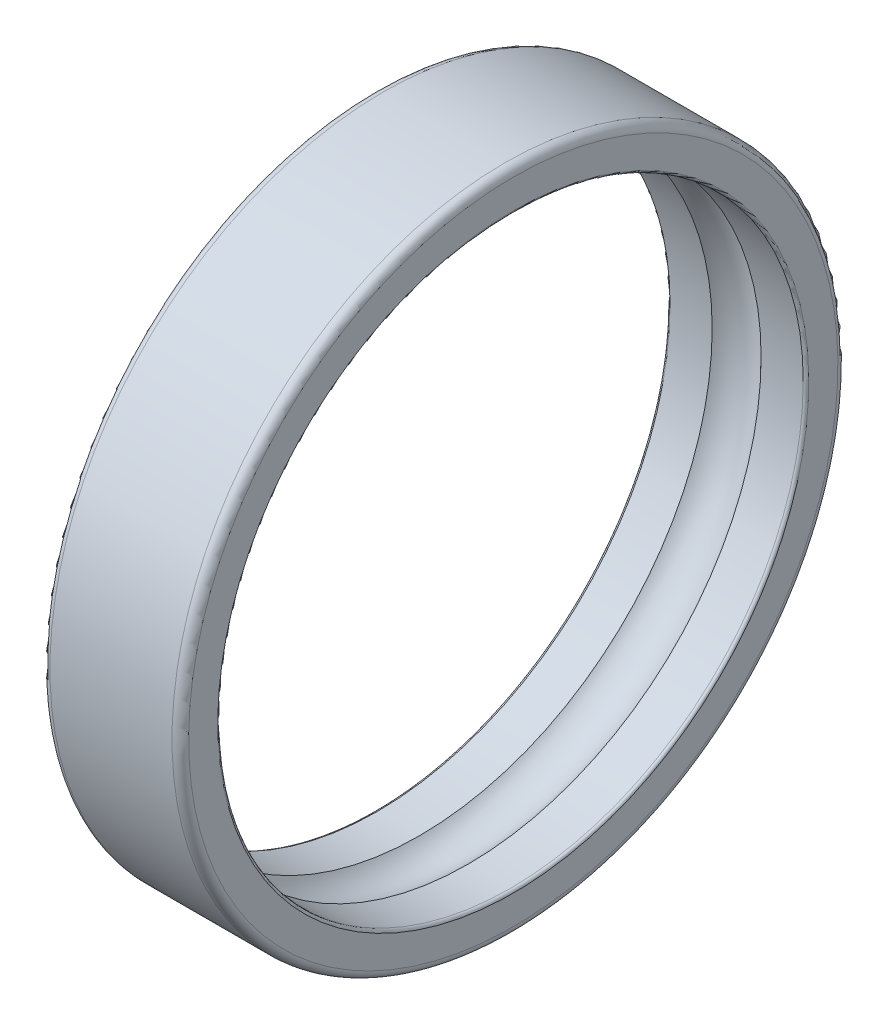
ISO-10303-21;
HEADER;
FILE_DESCRIPTION(('STEP AP214'),'2;1');
FILE_NAME('part.step','',(''),(''),'','','');
FILE_SCHEMA(('AUTOMOTIVE_DESIGN { 1 0 10303 214 1 1 1 1 }'));
ENDSEC;
DATA;
#1=APPLICATION_CONTEXT('core data for automotive mechanical design processes');
#2=APPLICATION_PROTOCOL_DEFINITION('international standard','automotive_design',2000,#1);
#3=PRODUCT_CONTEXT('',#1,'mechanical');
#4=PRODUCT('Part','Part','',(#3));
#5=PRODUCT_RELATED_PRODUCT_CATEGORY('part','',(#4));
#6=PRODUCT_DEFINITION_FORMATION('','',#4);
#7=PRODUCT_DEFINITION_CONTEXT('part definition',#1,'design');
#8=PRODUCT_DEFINITION('design','',#6,#7);
#9=PRODUCT_DEFINITION_SHAPE('','',#8);
#10=(LENGTH_UNIT() NAMED_UNIT(*) SI_UNIT(.MILLI.,.METRE.));
#11=(NAMED_UNIT(*) PLANE_ANGLE_UNIT() SI_UNIT($,.RADIAN.));
#12=(NAMED_UNIT(*) SI_UNIT($,.STERADIAN.) SOLID_ANGLE_UNIT());
#13=UNCERTAINTY_MEASURE_WITH_UNIT(LENGTH_MEASURE(1.E-05),#10,'distance_accuracy_value','');
#14=(GEOMETRIC_REPRESENTATION_CONTEXT(3) GLOBAL_UNCERTAINTY_ASSIGNED_CONTEXT((#13)) GLOBAL_UNIT_ASSIGNED_CONTEXT((#10,
#11,#12)) REPRESENTATION_CONTEXT('',''));
#15=CARTESIAN_POINT('',(0.,0.,0.));
#16=DIRECTION('',(0.,0.,1.));
#17=DIRECTION('',(1.,0.,0.));
#18=AXIS2_PLACEMENT_3D('',#15,#16,#17);
#19=CARTESIAN_POINT('',(0.299999999999946,0.,0.));
#20=DIRECTION('',(1.,0.,0.));
#21=DIRECTION('',(0.,1.,0.));
#22=AXIS2_PLACEMENT_3D('',#19,#20,#21);
#23=TOROIDAL_SURFACE('',#22,11.7000000000001,0.299999999999942);
#24=CARTESIAN_POINT('',(0.,0.,0.));
#25=DIRECTION('',(1.,0.,0.));
#26=DIRECTION('',(0.,1.,0.));
#27=AXIS2_PLACEMENT_3D('',#24,#25,#26);
#28=CIRCLE('',#27,11.7);
#29=CARTESIAN_POINT('',(0.,11.7,0.));
#30=VERTEX_POINT('',#29);
#31=EDGE_CURVE('E10',#30,#30,#28,.T.);
#32=ORIENTED_EDGE('',*,*,#31,.T.);
#33=EDGE_LOOP('',(#32));
#34=FACE_BOUND('',#33,.T.);
#35=CARTESIAN_POINT('',(0.300000000000004,0.,0.));
#36=DIRECTION('',(1.,0.,0.));
#37=DIRECTION('',(0.,1.,0.));
#38=AXIS2_PLACEMENT_3D('',#35,#36,#37);
#39=CIRCLE('',#38,12.);
#40=CARTESIAN_POINT('',(0.3,12.,0.));
#41=VERTEX_POINT('',#40);
#42=EDGE_CURVE('E70',#41,#41,#39,.T.);
#43=ORIENTED_EDGE('',*,*,#42,.F.);
#44=EDGE_LOOP('',(#43));
#45=FACE_BOUND('',#44,.T.);
#46=ADVANCED_FACE('F36',(#34,#45),#23,.T.);
#47=CARTESIAN_POINT('',(0.,11.7,0.));
#48=DIRECTION('',(-1.,0.,0.));
#49=DIRECTION('',(0.,-1.,0.));
#50=AXIS2_PLACEMENT_3D('',#47,#48,#49);
#51=PLANE('',#50);
#52=CARTESIAN_POINT('',(0.,0.,0.));
#53=DIRECTION('',(1.,0.,0.));
#54=DIRECTION('',(0.,1.,0.));
#55=AXIS2_PLACEMENT_3D('',#52,#53,#54);
#56=CIRCLE('',#55,10.65);
#57=CARTESIAN_POINT('',(0.,10.65,0.));
#58=VERTEX_POINT('',#57);
#59=EDGE_CURVE('E42',#58,#58,#56,.T.);
#60=ORIENTED_EDGE('',*,*,#59,.T.);
#61=EDGE_LOOP('',(#60));
#62=FACE_BOUND('',#61,.T.);
#63=ORIENTED_EDGE('',*,*,#31,.F.);
#64=EDGE_LOOP('',(#63));
#65=FACE_BOUND('',#64,.T.);
#66=ADVANCED_FACE('F78',(#62,#65),#51,.T.);
#67=CARTESIAN_POINT('',(0.0999999999994126,0.,0.));
#68=DIRECTION('',(1.,0.,0.));
#69=DIRECTION('',(0.,1.,0.));
#70=AXIS2_PLACEMENT_3D('',#67,#68,#69);
#71=TOROIDAL_SURFACE('',#70,10.6499999999994,0.0999999999994094);
#72=CARTESIAN_POINT('',(0.100000000000004,0.,0.));
#73=DIRECTION('',(1.,0.,0.));
#74=DIRECTION('',(0.,1.,0.));
#75=AXIS2_PLACEMENT_3D('',#72,#73,#74);
#76=CIRCLE('',#75,10.55);
#77=CARTESIAN_POINT('',(0.1,10.55,0.));
#78=VERTEX_POINT('',#77);
#79=EDGE_CURVE('E46',#78,#78,#76,.T.);
#80=ORIENTED_EDGE('',*,*,#79,.T.);
#81=EDGE_LOOP('',(#80));
#82=FACE_BOUND('',#81,.T.);
#83=ORIENTED_EDGE('',*,*,#59,.F.);
#84=EDGE_LOOP('',(#83));
#85=FACE_BOUND('',#84,.T.);
#86=ADVANCED_FACE('F82',(#82,#85),#71,.T.);
#87=CARTESIAN_POINT('',(5.,0.,0.));
#88=DIRECTION('',(1.,0.,0.));
#89=DIRECTION('',(0.,1.,0.));
#90=AXIS2_PLACEMENT_3D('',#87,#88,#89);
#91=CYLINDRICAL_SURFACE('',#90,10.55);
#92=CARTESIAN_POINT('',(1.6183593419085,0.,0.));
#93=DIRECTION('',(1.,0.,0.));
#94=DIRECTION('',(0.,1.,0.));
#95=AXIS2_PLACEMENT_3D('',#92,#93,#94);
#96=CIRCLE('',#95,10.55);
#97=CARTESIAN_POINT('',(1.6183593419085,10.55,0.));
#98=VERTEX_POINT('',#97);
#99=EDGE_CURVE('E50',#98,#98,#96,.T.);
#100=ORIENTED_EDGE('',*,*,#99,.T.);
#101=EDGE_LOOP('',(#100));
#102=FACE_BOUND('',#101,.T.);
#103=ORIENTED_EDGE('',*,*,#79,.F.);
#104=EDGE_LOOP('',(#103));
#105=FACE_BOUND('',#104,.T.);
#106=ADVANCED_FACE('F86',(#102,#105),#91,.F.);
#107=CARTESIAN_POINT('',(2.5,0.,0.));
#108=DIRECTION('',(1.,0.,0.));
#109=DIRECTION('',(0.,1.,0.));
#110=AXIS2_PLACEMENT_3D('',#107,#108,#109);
#111=TOROIDAL_SURFACE('',#110,9.74999999999998,1.19050000000002);
#112=CARTESIAN_POINT('',(3.3816406580915,0.,0.));
#113=DIRECTION('',(1.,0.,0.));
#114=DIRECTION('',(0.,1.,0.));
#115=AXIS2_PLACEMENT_3D('',#112,#113,#114);
#116=CIRCLE('',#115,10.55);
#117=CARTESIAN_POINT('',(3.3816406580915,10.55,0.));
#118=VERTEX_POINT('',#117);
#119=EDGE_CURVE('E55',#118,#118,#116,.T.);
#120=ORIENTED_EDGE('',*,*,#119,.T.);
#121=EDGE_LOOP('',(#120));
#122=FACE_BOUND('',#121,.T.);
#123=ORIENTED_EDGE('',*,*,#99,.F.);
#124=EDGE_LOOP('',(#123));
#125=FACE_BOUND('',#124,.T.);
#126=ADVANCED_FACE('F93',(#122,#125),#111,.F.);
#127=CARTESIAN_POINT('',(5.,0.,0.));
#128=DIRECTION('',(1.,0.,0.));
#129=DIRECTION('',(0.,1.,0.));
#130=AXIS2_PLACEMENT_3D('',#127,#128,#129);
#131=CYLINDRICAL_SURFACE('',#130,10.55);
#132=CARTESIAN_POINT('',(4.9,0.,0.));
#133=DIRECTION('',(1.,0.,0.));
#134=DIRECTION('',(0.,1.,0.));
#135=AXIS2_PLACEMENT_3D('',#132,#133,#134);
#136=CIRCLE('',#135,10.55);
#137=CARTESIAN_POINT('',(4.9,10.55,0.));
#138=VERTEX_POINT('',#137);
#139=EDGE_CURVE('E58',#138,#138,#136,.T.);
#140=ORIENTED_EDGE('',*,*,#139,.T.);
#141=EDGE_LOOP('',(#140));
#142=FACE_BOUND('',#141,.T.);
#143=ORIENTED_EDGE('',*,*,#119,.F.);
#144=EDGE_LOOP('',(#143));
#145=FACE_BOUND('',#144,.T.);
#146=ADVANCED_FACE('F97',(#142,#145),#131,.F.);
#147=CARTESIAN_POINT('',(4.90000000000067,0.,0.));
#148=DIRECTION('',(1.,0.,0.));
#149=DIRECTION('',(0.,1.,0.));
#150=AXIS2_PLACEMENT_3D('',#147,#148,#149);
#151=TOROIDAL_SURFACE('',#150,10.6499999999993,0.099999999999332);
#152=CARTESIAN_POINT('',(5.,0.,0.));
#153=DIRECTION('',(1.,0.,0.));
#154=DIRECTION('',(0.,1.,0.));
#155=AXIS2_PLACEMENT_3D('',#152,#153,#154);
#156=CIRCLE('',#155,10.65);
#157=CARTESIAN_POINT('',(5.,10.65,0.));
#158=VERTEX_POINT('',#157);
#159=EDGE_CURVE('E61',#158,#158,#156,.T.);
#160=ORIENTED_EDGE('',*,*,#159,.T.);
#161=EDGE_LOOP('',(#160));
#162=FACE_BOUND('',#161,.T.);
#163=ORIENTED_EDGE('',*,*,#139,.F.);
#164=EDGE_LOOP('',(#163));
#165=FACE_BOUND('',#164,.T.);
#166=ADVANCED_FACE('F101',(#162,#165),#151,.T.);
#167=CARTESIAN_POINT('',(5.,10.65,0.));
#168=DIRECTION('',(1.,0.,0.));
#169=DIRECTION('',(0.,1.,0.));
#170=AXIS2_PLACEMENT_3D('',#167,#168,#169);
#171=PLANE('',#170);
#172=CARTESIAN_POINT('',(5.,0.,0.));
#173=DIRECTION('',(1.,0.,0.));
#174=DIRECTION('',(0.,1.,0.));
#175=AXIS2_PLACEMENT_3D('',#172,#173,#174);
#176=CIRCLE('',#175,11.7);
#177=CARTESIAN_POINT('',(5.,11.7,0.));
#178=VERTEX_POINT('',#177);
#179=EDGE_CURVE('E64',#178,#178,#176,.T.);
#180=ORIENTED_EDGE('',*,*,#179,.T.);
#181=EDGE_LOOP('',(#180));
#182=FACE_BOUND('',#181,.T.);
#183=ORIENTED_EDGE('',*,*,#159,.F.);
#184=EDGE_LOOP('',(#183));
#185=FACE_BOUND('',#184,.T.);
#186=ADVANCED_FACE('F105',(#182,#185),#171,.T.);
#187=CARTESIAN_POINT('',(4.70000000000013,0.,0.));
#188=DIRECTION('',(1.,0.,0.));
#189=DIRECTION('',(0.,1.,0.));
#190=AXIS2_PLACEMENT_3D('',#187,#188,#189);
#191=TOROIDAL_SURFACE('',#190,11.7000000000001,0.29999999999988);
#192=CARTESIAN_POINT('',(4.7,0.,0.));
#193=DIRECTION('',(1.,0.,0.));
#194=DIRECTION('',(0.,1.,0.));
#195=AXIS2_PLACEMENT_3D('',#192,#193,#194);
#196=CIRCLE('',#195,12.);
#197=CARTESIAN_POINT('',(4.7,12.,0.));
#198=VERTEX_POINT('',#197);
#199=EDGE_CURVE('E67',#198,#198,#196,.T.);
#200=ORIENTED_EDGE('',*,*,#199,.T.);
#201=EDGE_LOOP('',(#200));
#202=FACE_BOUND('',#201,.T.);
#203=ORIENTED_EDGE('',*,*,#179,.F.);
#204=EDGE_LOOP('',(#203));
#205=FACE_BOUND('',#204,.T.);
#206=ADVANCED_FACE('F109',(#202,#205),#191,.T.);
#207=CARTESIAN_POINT('',(5.,0.,0.));
#208=DIRECTION('',(1.,0.,0.));
#209=DIRECTION('',(0.,1.,0.));
#210=AXIS2_PLACEMENT_3D('',#207,#208,#209);
#211=CYLINDRICAL_SURFACE('',#210,12.);
#212=ORIENTED_EDGE('',*,*,#42,.T.);
#213=EDGE_LOOP('',(#212));
#214=FACE_BOUND('',#213,.T.);
#215=ORIENTED_EDGE('',*,*,#199,.F.);
#216=EDGE_LOOP('',(#215));
#217=FACE_BOUND('',#216,.T.);
#218=ADVANCED_FACE('F74',(#214,#217),#211,.T.);
#219=CLOSED_SHELL('',(#46,#66,#86,#106,#126,#146,#166,#186,#206,#218));
#220=MANIFOLD_SOLID_BREP('B2',#219);
#221=ADVANCED_BREP_SHAPE_REPRESENTATION('',(#18,#220),#14);
#222=SHAPE_DEFINITION_REPRESENTATION(#9,#221);
ENDSEC;
END-ISO-10303-21;
